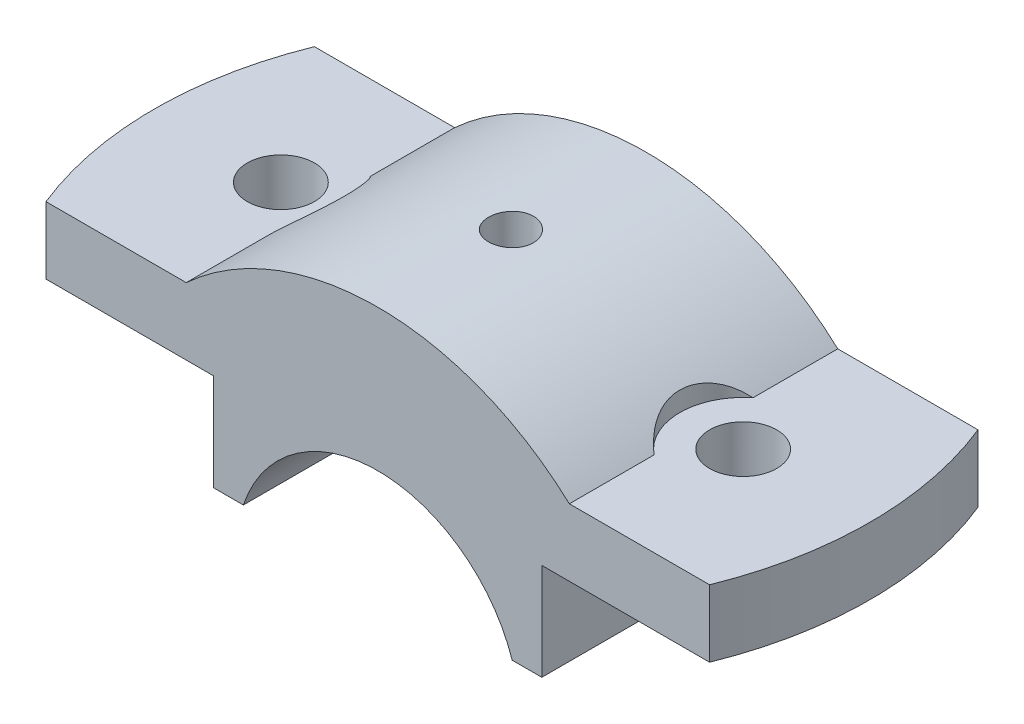
ISO-10303-21;
HEADER;
FILE_DESCRIPTION(('STEP AP214'),'2;1');
FILE_NAME('part.step','',(''),(''),'','','');
FILE_SCHEMA(('AUTOMOTIVE_DESIGN { 1 0 10303 214 1 1 1 1 }'));
ENDSEC;
DATA;
#1=APPLICATION_CONTEXT('core data for automotive mechanical design processes');
#2=APPLICATION_PROTOCOL_DEFINITION('international standard','automotive_design',2000,#1);
#3=PRODUCT_CONTEXT('',#1,'mechanical');
#4=PRODUCT('Part','Part','',(#3));
#5=PRODUCT_RELATED_PRODUCT_CATEGORY('part','',(#4));
#6=PRODUCT_DEFINITION_FORMATION('','',#4);
#7=PRODUCT_DEFINITION_CONTEXT('part definition',#1,'design');
#8=PRODUCT_DEFINITION('design','',#6,#7);
#9=PRODUCT_DEFINITION_SHAPE('','',#8);
#10=(LENGTH_UNIT() NAMED_UNIT(*) SI_UNIT(.MILLI.,.METRE.));
#11=(NAMED_UNIT(*) PLANE_ANGLE_UNIT() SI_UNIT($,.RADIAN.));
#12=(NAMED_UNIT(*) SI_UNIT($,.STERADIAN.) SOLID_ANGLE_UNIT());
#13=UNCERTAINTY_MEASURE_WITH_UNIT(LENGTH_MEASURE(1.E-05),#10,'distance_accuracy_value','');
#14=(GEOMETRIC_REPRESENTATION_CONTEXT(3) GLOBAL_UNCERTAINTY_ASSIGNED_CONTEXT((#13)) GLOBAL_UNIT_ASSIGNED_CONTEXT((#10,
#11,#12)) REPRESENTATION_CONTEXT('',''));
#15=CARTESIAN_POINT('',(0.,0.,0.));
#16=DIRECTION('',(0.,0.,1.));
#17=DIRECTION('',(1.,0.,0.));
#18=AXIS2_PLACEMENT_3D('',#15,#16,#17);
#19=CARTESIAN_POINT('',(0.,0.,-18.));
#20=DIRECTION('',(0.,0.,-1.));
#21=DIRECTION('',(-1.,0.,0.));
#22=AXIS2_PLACEMENT_3D('',#19,#20,#21);
#23=PLANE('',#22);
#24=DIRECTION('',(1.,0.,0.));
#25=VECTOR('',#24,1.);
#26=CARTESIAN_POINT('',(50.,28.,-18.));
#27=LINE('',#26,#25);
#28=CARTESIAN_POINT('',(25.6904651573303,28.,-18.));
#29=VERTEX_POINT('',#28);
#30=CARTESIAN_POINT('',(44.497190922574,28.,-18.));
#31=VERTEX_POINT('',#30);
#32=EDGE_CURVE('E181',#29,#31,#27,.T.);
#33=ORIENTED_EDGE('',*,*,#32,.T.);
#34=DIRECTION('',(0.,1.,0.));
#35=VECTOR('',#34,1.);
#36=CARTESIAN_POINT('',(44.497190922574,6.,-18.));
#37=LINE('',#36,#35);
#38=CARTESIAN_POINT('',(44.497190922574,19.,-18.));
#39=VERTEX_POINT('',#38);
#40=EDGE_CURVE('E140',#39,#31,#37,.T.);
#41=ORIENTED_EDGE('',*,*,#40,.F.);
#42=DIRECTION('',(-1.,0.,0.));
#43=VECTOR('',#42,1.);
#44=CARTESIAN_POINT('',(22.,19.,-18.));
#45=LINE('',#44,#43);
#46=CARTESIAN_POINT('',(22.,19.,-18.));
#47=VERTEX_POINT('',#46);
#48=EDGE_CURVE('E303',#39,#47,#45,.T.);
#49=ORIENTED_EDGE('',*,*,#48,.T.);
#50=DIRECTION('',(0.,-1.,0.));
#51=VECTOR('',#50,1.);
#52=CARTESIAN_POINT('',(22.,6.,-18.));
#53=LINE('',#52,#51);
#54=CARTESIAN_POINT('',(22.,6.,-18.));
#55=VERTEX_POINT('',#54);
#56=EDGE_CURVE('E162',#47,#55,#53,.T.);
#57=ORIENTED_EDGE('',*,*,#56,.T.);
#58=DIRECTION('',(-1.,0.,0.));
#59=VECTOR('',#58,1.);
#60=CARTESIAN_POINT('',(18.0277563773199,6.,-18.));
#61=LINE('',#60,#59);
#62=CARTESIAN_POINT('',(18.0277563773199,6.,-18.));
#63=VERTEX_POINT('',#62);
#64=EDGE_CURVE('E159',#55,#63,#61,.T.);
#65=ORIENTED_EDGE('',*,*,#64,.T.);
#66=CARTESIAN_POINT('',(0.,0.,-18.));
#67=DIRECTION('',(0.,0.,-1.));
#68=DIRECTION('',(-1.,0.,0.));
#69=AXIS2_PLACEMENT_3D('',#66,#67,#68);
#70=CIRCLE('',#69,19.);
#71=CARTESIAN_POINT('',(-18.0277563773199,6.,-18.));
#72=VERTEX_POINT('',#71);
#73=EDGE_CURVE('E182',#72,#63,#70,.T.);
#74=ORIENTED_EDGE('',*,*,#73,.F.);
#75=DIRECTION('',(1.,0.,0.));
#76=VECTOR('',#75,1.);
#77=CARTESIAN_POINT('',(-18.0277563773199,6.,-18.));
#78=LINE('',#77,#76);
#79=CARTESIAN_POINT('',(-22.,6.,-18.));
#80=VERTEX_POINT('',#79);
#81=EDGE_CURVE('E196',#80,#72,#78,.T.);
#82=ORIENTED_EDGE('',*,*,#81,.F.);
#83=DIRECTION('',(0.,-1.,0.));
#84=VECTOR('',#83,1.);
#85=CARTESIAN_POINT('',(-22.,6.,-18.));
#86=LINE('',#85,#84);
#87=CARTESIAN_POINT('',(-22.,19.,-18.));
#88=VERTEX_POINT('',#87);
#89=EDGE_CURVE('E193',#88,#80,#86,.T.);
#90=ORIENTED_EDGE('',*,*,#89,.F.);
#91=DIRECTION('',(1.,0.,0.));
#92=VECTOR('',#91,1.);
#93=CARTESIAN_POINT('',(-22.,19.,-18.));
#94=LINE('',#93,#92);
#95=CARTESIAN_POINT('',(-44.497190922574,19.,-18.));
#96=VERTEX_POINT('',#95);
#97=EDGE_CURVE('E191',#96,#88,#94,.T.);
#98=ORIENTED_EDGE('',*,*,#97,.F.);
#99=DIRECTION('',(0.,1.,0.));
#100=VECTOR('',#99,1.);
#101=CARTESIAN_POINT('',(-44.497190922574,6.,-18.));
#102=LINE('',#101,#100);
#103=CARTESIAN_POINT('',(-44.497190922574,28.,-18.));
#104=VERTEX_POINT('',#103);
#105=EDGE_CURVE('E362',#96,#104,#102,.T.);
#106=ORIENTED_EDGE('',*,*,#105,.T.);
#107=DIRECTION('',(-1.,0.,0.));
#108=VECTOR('',#107,1.);
#109=CARTESIAN_POINT('',(-50.,28.,-18.));
#110=LINE('',#109,#108);
#111=CARTESIAN_POINT('',(-25.6904651573303,28.,-18.));
#112=VERTEX_POINT('',#111);
#113=EDGE_CURVE('E188',#112,#104,#110,.T.);
#114=ORIENTED_EDGE('',*,*,#113,.F.);
#115=CARTESIAN_POINT('',(0.,0.,-18.));
#116=DIRECTION('',(0.,0.,1.));
#117=DIRECTION('',(-1.,0.,0.));
#118=AXIS2_PLACEMENT_3D('',#115,#116,#117);
#119=CIRCLE('',#118,38.);
#120=EDGE_CURVE('E184',#29,#112,#119,.T.);
#121=ORIENTED_EDGE('',*,*,#120,.F.);
#122=EDGE_LOOP('',(#33,#41,#49,#57,#65,#74,#82,#90,#98,#106,#114,#121));
#123=FACE_BOUND('',#122,.T.);
#124=ADVANCED_FACE('F33',(#123),#23,.T.);
#125=CARTESIAN_POINT('',(0.,0.,18.));
#126=DIRECTION('',(0.,0.,-1.));
#127=DIRECTION('',(-1.,0.,0.));
#128=AXIS2_PLACEMENT_3D('',#125,#126,#127);
#129=PLANE('',#128);
#130=DIRECTION('',(0.,1.,0.));
#131=VECTOR('',#130,1.);
#132=CARTESIAN_POINT('',(44.497190922574,6.,18.));
#133=LINE('',#132,#131);
#134=CARTESIAN_POINT('',(44.497190922574,19.,18.));
#135=VERTEX_POINT('',#134);
#136=CARTESIAN_POINT('',(44.497190922574,28.,18.));
#137=VERTEX_POINT('',#136);
#138=EDGE_CURVE('E53',#135,#137,#133,.T.);
#139=ORIENTED_EDGE('',*,*,#138,.T.);
#140=DIRECTION('',(1.,0.,0.));
#141=VECTOR('',#140,1.);
#142=CARTESIAN_POINT('',(50.,28.,18.));
#143=LINE('',#142,#141);
#144=CARTESIAN_POINT('',(25.6904651573303,28.,18.));
#145=VERTEX_POINT('',#144);
#146=EDGE_CURVE('E151',#145,#137,#143,.T.);
#147=ORIENTED_EDGE('',*,*,#146,.F.);
#148=CARTESIAN_POINT('',(0.,0.,18.));
#149=DIRECTION('',(0.,0.,1.));
#150=DIRECTION('',(-1.,0.,0.));
#151=AXIS2_PLACEMENT_3D('',#148,#149,#150);
#152=CIRCLE('',#151,38.);
#153=CARTESIAN_POINT('',(-25.6904651573303,28.,18.));
#154=VERTEX_POINT('',#153);
#155=EDGE_CURVE('E201',#145,#154,#152,.T.);
#156=ORIENTED_EDGE('',*,*,#155,.T.);
#157=DIRECTION('',(-1.,0.,0.));
#158=VECTOR('',#157,1.);
#159=CARTESIAN_POINT('',(-50.,28.,18.));
#160=LINE('',#159,#158);
#161=CARTESIAN_POINT('',(-44.497190922574,28.,18.));
#162=VERTEX_POINT('',#161);
#163=EDGE_CURVE('E203',#154,#162,#160,.T.);
#164=ORIENTED_EDGE('',*,*,#163,.T.);
#165=DIRECTION('',(0.,1.,0.));
#166=VECTOR('',#165,1.);
#167=CARTESIAN_POINT('',(-44.497190922574,6.,18.));
#168=LINE('',#167,#166);
#169=CARTESIAN_POINT('',(-44.497190922574,19.,18.));
#170=VERTEX_POINT('',#169);
#171=EDGE_CURVE('E230',#162,#170,#168,.F.);
#172=ORIENTED_EDGE('',*,*,#171,.T.);
#173=DIRECTION('',(1.,0.,0.));
#174=VECTOR('',#173,1.);
#175=CARTESIAN_POINT('',(-22.,19.,18.));
#176=LINE('',#175,#174);
#177=CARTESIAN_POINT('',(-22.,19.,18.));
#178=VERTEX_POINT('',#177);
#179=EDGE_CURVE('E206',#170,#178,#176,.T.);
#180=ORIENTED_EDGE('',*,*,#179,.T.);
#181=DIRECTION('',(0.,-1.,0.));
#182=VECTOR('',#181,1.);
#183=CARTESIAN_POINT('',(-22.,6.,18.));
#184=LINE('',#183,#182);
#185=CARTESIAN_POINT('',(-22.,6.,18.));
#186=VERTEX_POINT('',#185);
#187=EDGE_CURVE('E208',#178,#186,#184,.T.);
#188=ORIENTED_EDGE('',*,*,#187,.T.);
#189=DIRECTION('',(1.,0.,0.));
#190=VECTOR('',#189,1.);
#191=CARTESIAN_POINT('',(-18.0277563773199,6.,18.));
#192=LINE('',#191,#190);
#193=CARTESIAN_POINT('',(-18.0277563773199,6.,18.));
#194=VERTEX_POINT('',#193);
#195=EDGE_CURVE('E185',#186,#194,#192,.T.);
#196=ORIENTED_EDGE('',*,*,#195,.T.);
#197=CARTESIAN_POINT('',(0.,0.,18.));
#198=DIRECTION('',(0.,0.,-1.));
#199=DIRECTION('',(-1.,0.,0.));
#200=AXIS2_PLACEMENT_3D('',#197,#198,#199);
#201=CIRCLE('',#200,19.);
#202=CARTESIAN_POINT('',(18.0277563773199,6.,18.));
#203=VERTEX_POINT('',#202);
#204=EDGE_CURVE('E171',#194,#203,#201,.T.);
#205=ORIENTED_EDGE('',*,*,#204,.T.);
#206=DIRECTION('',(-1.,0.,0.));
#207=VECTOR('',#206,1.);
#208=CARTESIAN_POINT('',(18.0277563773199,6.,18.));
#209=LINE('',#208,#207);
#210=CARTESIAN_POINT('',(22.,6.,18.));
#211=VERTEX_POINT('',#210);
#212=EDGE_CURVE('E296',#211,#203,#209,.T.);
#213=ORIENTED_EDGE('',*,*,#212,.F.);
#214=DIRECTION('',(0.,-1.,0.));
#215=VECTOR('',#214,1.);
#216=CARTESIAN_POINT('',(22.,6.,18.));
#217=LINE('',#216,#215);
#218=CARTESIAN_POINT('',(22.,19.,18.));
#219=VERTEX_POINT('',#218);
#220=EDGE_CURVE('E164',#219,#211,#217,.T.);
#221=ORIENTED_EDGE('',*,*,#220,.F.);
#222=DIRECTION('',(-1.,0.,0.));
#223=VECTOR('',#222,1.);
#224=CARTESIAN_POINT('',(22.,19.,18.));
#225=LINE('',#224,#223);
#226=EDGE_CURVE('E153',#135,#219,#225,.T.);
#227=ORIENTED_EDGE('',*,*,#226,.F.);
#228=EDGE_LOOP('',(#139,#147,#156,#164,#172,#180,#188,#196,#205,#213,#221,#227));
#229=FACE_BOUND('',#228,.T.);
#230=ADVANCED_FACE('F149',(#229),#129,.F.);
#231=CARTESIAN_POINT('',(50.,28.,-18.));
#232=DIRECTION('',(0.,-1.,0.));
#233=DIRECTION('',(0.,0.,-1.));
#234=AXIS2_PLACEMENT_3D('',#231,#232,#233);
#235=PLANE('',#234);
#236=CARTESIAN_POINT('',(31.,28.,0.));
#237=DIRECTION('',(0.,1.,0.));
#238=DIRECTION('',(0.,0.,1.));
#239=AXIS2_PLACEMENT_3D('',#236,#237,#238);
#240=CIRCLE('',#239,4.49999999999999);
#241=CARTESIAN_POINT('',(31.,28.,4.49999999999999));
#242=VERTEX_POINT('',#241);
#243=EDGE_CURVE('E385',#242,#242,#240,.T.);
#244=ORIENTED_EDGE('',*,*,#243,.F.);
#245=EDGE_LOOP('',(#244));
#246=FACE_BOUND('',#245,.T.);
#247=CARTESIAN_POINT('',(0.,28.,0.));
#248=DIRECTION('',(0.,1.,0.));
#249=DIRECTION('',(0.,0.,-1.));
#250=AXIS2_PLACEMENT_3D('',#247,#248,#249);
#251=CIRCLE('',#250,48.);
#252=EDGE_CURVE('E137',#137,#31,#251,.T.);
#253=ORIENTED_EDGE('',*,*,#252,.T.);
#254=ORIENTED_EDGE('',*,*,#32,.F.);
#255=DIRECTION('',(0.,0.,1.));
#256=VECTOR('',#255,1.);
#257=CARTESIAN_POINT('',(25.6904651573303,28.,-18.));
#258=LINE('',#257,#256);
#259=CARTESIAN_POINT('',(25.6904651573303,28.,-6.63768331230679));
#260=VERTEX_POINT('',#259);
#261=EDGE_CURVE('E168',#29,#260,#258,.T.);
#262=ORIENTED_EDGE('',*,*,#261,.T.);
#263=CARTESIAN_POINT('',(31.,28.,0.));
#264=DIRECTION('',(0.,-1.,0.));
#265=DIRECTION('',(0.,0.,1.));
#266=AXIS2_PLACEMENT_3D('',#263,#264,#265);
#267=CIRCLE('',#266,8.5);
#268=CARTESIAN_POINT('',(25.6904651573303,28.,6.63768331230679));
#269=VERTEX_POINT('',#268);
#270=EDGE_CURVE('E353',#269,#260,#267,.T.);
#271=ORIENTED_EDGE('',*,*,#270,.F.);
#272=EDGE_CURVE('E157',#269,#145,#258,.T.);
#273=ORIENTED_EDGE('',*,*,#272,.T.);
#274=ORIENTED_EDGE('',*,*,#146,.T.);
#275=EDGE_LOOP('',(#253,#254,#262,#271,#273,#274));
#276=FACE_BOUND('',#275,.T.);
#277=ADVANCED_FACE('F155',(#246,#276),#235,.F.);
#278=CARTESIAN_POINT('',(22.,19.,-18.));
#279=DIRECTION('',(0.,1.,0.));
#280=DIRECTION('',(-1.,0.,0.));
#281=AXIS2_PLACEMENT_3D('',#278,#279,#280);
#282=PLANE('',#281);
#283=CARTESIAN_POINT('',(31.,19.,0.));
#284=DIRECTION('',(0.,1.,0.));
#285=DIRECTION('',(-1.,0.,0.));
#286=AXIS2_PLACEMENT_3D('',#283,#284,#285);
#287=CIRCLE('',#286,4.49999999999999);
#288=CARTESIAN_POINT('',(26.5,19.,0.));
#289=VERTEX_POINT('',#288);
#290=EDGE_CURVE('E382',#289,#289,#287,.T.);
#291=ORIENTED_EDGE('',*,*,#290,.T.);
#292=EDGE_LOOP('',(#291));
#293=FACE_BOUND('',#292,.T.);
#294=CARTESIAN_POINT('',(0.,19.,0.));
#295=DIRECTION('',(0.,1.,0.));
#296=DIRECTION('',(-1.,0.,0.));
#297=AXIS2_PLACEMENT_3D('',#294,#295,#296);
#298=CIRCLE('',#297,48.);
#299=EDGE_CURVE('E46',#135,#39,#298,.T.);
#300=ORIENTED_EDGE('',*,*,#299,.F.);
#301=ORIENTED_EDGE('',*,*,#226,.T.);
#302=DIRECTION('',(0.,0.,1.));
#303=VECTOR('',#302,1.);
#304=CARTESIAN_POINT('',(22.,19.,-18.));
#305=LINE('',#304,#303);
#306=EDGE_CURVE('E172',#47,#219,#305,.T.);
#307=ORIENTED_EDGE('',*,*,#306,.F.);
#308=ORIENTED_EDGE('',*,*,#48,.F.);
#309=EDGE_LOOP('',(#300,#301,#307,#308));
#310=FACE_BOUND('',#309,.T.);
#311=ADVANCED_FACE('F251',(#293,#310),#282,.F.);
#312=CARTESIAN_POINT('',(0.,0.,-18.));
#313=DIRECTION('',(0.,0.,1.));
#314=DIRECTION('',(1.,0.,0.));
#315=AXIS2_PLACEMENT_3D('',#312,#313,#314);
#316=CYLINDRICAL_SURFACE('',#315,38.);
#317=CARTESIAN_POINT('',(-3.1458817359675,37.8695580658569,0.));
#318=CARTESIAN_POINT('',(-3.14587437994102,37.8695596692857,0.168229356223722));
#319=CARTESIAN_POINT('',(-3.1316880525212,37.8707454515949,0.336574006245494));
#320=CARTESIAN_POINT('',(-3.07530332802036,37.8753650637653,0.668607649957892));
#321=CARTESIAN_POINT('',(-3.03307298830084,37.8788014570518,0.83229111249956));
#322=CARTESIAN_POINT('',(-2.92182616659471,37.8875444761835,1.1501452237575));
#323=CARTESIAN_POINT('',(-2.85282462512546,37.892850058717,1.30432112294824));
#324=CARTESIAN_POINT('',(-2.6900185025226,37.90475471927,1.59886160168987));
#325=CARTESIAN_POINT('',(-2.59621931204265,37.9113535160827,1.73922917388467));
#326=CARTESIAN_POINT('',(-2.38624301776559,37.9251487044451,2.00253137226757));
#327=CARTESIAN_POINT('',(-2.27002035602962,37.9323462953406,2.12542960763649));
#328=CARTESIAN_POINT('',(-2.01859004696914,37.9465560480246,2.34999209013841));
#329=CARTESIAN_POINT('',(-1.88338157954225,37.9535682017876,2.45165541954577));
#330=CARTESIAN_POINT('',(-1.59760066015428,37.9666712775513,2.63098168610704));
#331=CARTESIAN_POINT('',(-1.44700854301351,37.9727609950746,2.708613379424));
#332=CARTESIAN_POINT('',(-1.13487054889193,37.9833704253793,2.83747282349098));
#333=CARTESIAN_POINT('',(-0.973324846202923,37.987890163135,2.88870099425837));
#334=CARTESIAN_POINT('',(-0.644224315781861,37.9948943007702,2.96319512715381));
#335=CARTESIAN_POINT('',(-0.476682834761507,37.9973829594895,2.98651964678537));
#336=CARTESIAN_POINT('',(-0.140044955685562,38.0001146758458,3.0047253592679));
#337=CARTESIAN_POINT('',(0.0290514160698927,38.0003577713957,2.99960703233397));
#338=CARTESIAN_POINT('',(0.363601957188222,37.9986279022662,2.96112032248106));
#339=CARTESIAN_POINT('',(0.529063402630801,37.9966598742563,2.92781491240173));
#340=CARTESIAN_POINT('',(0.852047650227197,37.9907899596693,2.83399732705022));
#341=CARTESIAN_POINT('',(1.00957038342975,37.9868880562987,2.77348491551835));
#342=CARTESIAN_POINT('',(1.31240509330863,37.9776328068828,2.62690060373557));
#343=CARTESIAN_POINT('',(1.45770332945107,37.972277855404,2.54080042217035));
#344=CARTESIAN_POINT('',(1.73181259590439,37.960764940049,2.34550517866702));
#345=CARTESIAN_POINT('',(1.86062332654852,37.9546069615815,2.23630969705861));
#346=CARTESIAN_POINT('',(2.09846708827653,37.9422019527286,1.99756841972296));
#347=CARTESIAN_POINT('',(2.20744520522019,37.9359547252317,1.86796791907116));
#348=CARTESIAN_POINT('',(2.40210396423434,37.9241273765005,1.59228636571935));
#349=CARTESIAN_POINT('',(2.48778458983251,37.9185472557377,1.44620530136698));
#350=CARTESIAN_POINT('',(2.63341176605231,37.9087126702961,1.14167162060739));
#351=CARTESIAN_POINT('',(2.69335559209279,37.9044583459834,0.983217696466577));
#352=CARTESIAN_POINT('',(2.78576609633738,37.8977792566554,0.658454052626345));
#353=CARTESIAN_POINT('',(2.81823329228586,37.8953544571664,0.492144481013881));
#354=CARTESIAN_POINT('',(2.85469879763537,37.8926250743431,0.156870629588009));
#355=CARTESIAN_POINT('',(2.85877365119076,37.8923147904437,-0.0120852808075258));
#356=CARTESIAN_POINT('',(2.83853908183502,37.8938358419192,-0.348277674479458));
#357=CARTESIAN_POINT('',(2.81422989615653,37.8956671593946,-0.515514172114852));
#358=CARTESIAN_POINT('',(2.73798168232659,37.9012519510283,-0.843301603254928));
#359=CARTESIAN_POINT('',(2.68607826501754,37.9050029475742,-1.00386086655318));
#360=CARTESIAN_POINT('',(2.55615238559372,37.9139855568988,-1.31399395677734));
#361=CARTESIAN_POINT('',(2.47812954670919,37.9192171910354,-1.46356762519929));
#362=CARTESIAN_POINT('',(2.2979872666667,37.9305600537958,-1.74783416137562));
#363=CARTESIAN_POINT('',(2.19581675961448,37.9366731356157,-1.88249459296493));
#364=CARTESIAN_POINT('',(1.97035540087016,37.9490502222694,-2.13278456634996));
#365=CARTESIAN_POINT('',(1.84706422262255,37.9553142294356,-2.24841381384239));
#366=CARTESIAN_POINT('',(1.5825330622276,37.9672638511389,-2.45761968980163));
#367=CARTESIAN_POINT('',(1.44125372985819,37.9729481468879,-2.55114664697588));
#368=CARTESIAN_POINT('',(1.14495525345122,37.983035969604,-2.71315246287969));
#369=CARTESIAN_POINT('',(0.989936234584203,37.9874395082375,-2.78163154976985));
#370=CARTESIAN_POINT('',(0.670739514283648,37.9944146158817,-2.8915121915042));
#371=CARTESIAN_POINT('',(0.506572492167628,37.996988274693,-2.93294463032733));
#372=CARTESIAN_POINT('',(0.173593831336894,37.9999680707691,-2.98765683143964));
#373=CARTESIAN_POINT('',(0.00478227068112589,38.0003742444396,-3.00093706657949));
#374=CARTESIAN_POINT('',(-0.332203125642705,37.9989204613857,-2.99896261174756));
#375=CARTESIAN_POINT('',(-0.5003774473114,37.9970666629141,-2.98378540562109));
#376=CARTESIAN_POINT('',(-0.83177276800804,37.9912572809989,-2.92548825985853));
#377=CARTESIAN_POINT('',(-0.994993759767166,37.9873016944712,-2.88236827921959));
#378=CARTESIAN_POINT('',(-1.31185669977632,37.9776799810049,-2.76942883565186));
#379=CARTESIAN_POINT('',(-1.46549906674205,37.9720139289001,-2.69961054075428));
#380=CARTESIAN_POINT('',(-1.75888889286831,37.9595560686898,-2.53526551305572));
#381=CARTESIAN_POINT('',(-1.89863660438796,37.9527642810362,-2.44073922912224));
#382=CARTESIAN_POINT('',(-2.16066823837924,37.9387506891864,-2.22937105364119));
#383=CARTESIAN_POINT('',(-2.28290599631364,37.9315278168967,-2.11247200370349));
#384=CARTESIAN_POINT('',(-2.50607333703597,37.9174384052283,-1.85977604977668));
#385=CARTESIAN_POINT('',(-2.60699774008364,37.9105719527746,-1.72397456524185));
#386=CARTESIAN_POINT('',(-2.78479740951612,37.8979272091236,-1.43709086811672));
#387=CARTESIAN_POINT('',(-2.86163094976766,37.8921508127505,-1.28598273615028));
#388=CARTESIAN_POINT('',(-2.98874444503889,37.8823376902094,-0.97306834736823));
#389=CARTESIAN_POINT('',(-3.03905506281121,37.8782989561542,-0.811274688620422));
#390=CARTESIAN_POINT('',(-3.09882056806893,37.873444865864,-0.54043166318695));
#391=CARTESIAN_POINT('',(-3.11644521469423,37.8719937513483,-0.433126408915516));
#392=CARTESIAN_POINT('',(-3.13997815996934,37.8700498347475,-0.217230128113446));
#393=CARTESIAN_POINT('',(-3.14588648634014,37.8695570303951,-0.10863910462557));
#394=CARTESIAN_POINT('',(-3.1458817359675,37.8695580658569,0.));
#395=B_SPLINE_CURVE_WITH_KNOTS('',3,(#317,#318,#319,#320,#321,#322,#323,#324,#325,#326,#327,
#328,#329,#330,#331,#332,#333,#334,#335,#336,#337,#338,#339,#340,#341,#342,#343,#344,#345,#346,
#347,#348,#349,#350,#351,#352,#353,#354,#355,#356,#357,#358,#359,#360,#361,#362,#363,#364,#365,
#366,#367,#368,#369,#370,#371,#372,#373,#374,#375,#376,#377,#378,#379,#380,#381,#382,#383,#384,
#385,#386,#387,#388,#389,#390,#391,#392,#393,#394),.UNSPECIFIED.,.T.,.F.,(4,2,2,2,2,2,2,2,2,2,2,
2,2,2,2,2,2,2,2,2,2,2,2,2,2,2,2,2,2,2,2,2,2,2,2,2,2,2,4),(0.,0.504291421669989,1.00915822788302,
1.51374368152856,2.01821953559138,2.52373134073237,3.02926498845646,3.53545315301367,
4.04163326507021,4.546749253583,5.05185671399058,5.55583868228782,6.05982502713927,
6.56437049631086,7.06892513448829,7.5748562462125,8.08078771565083,8.58677273143866,
9.09274821269729,9.59735908295554,10.1019657357268,10.6059227598395,11.10988705379,
11.6149267875576,12.1199743306602,12.6261463157288,13.1323136899712,13.6379020669613,
14.1434819519092,14.6476872439429,15.1518932758423,15.6560772516295,16.1602520685946,
16.6657325841807,17.1713358046312,17.6778099691558,18.1836973153047,18.5093592531183,
18.8350204204102),.UNSPECIFIED.);
#396=CARTESIAN_POINT('',(-3.1458817359675,37.8695580658569,0.));
#397=VERTEX_POINT('',#396);
#398=EDGE_CURVE('E11',#397,#397,#395,.T.);
#399=ORIENTED_EDGE('',*,*,#398,.F.);
#400=EDGE_LOOP('',(#399));
#401=FACE_BOUND('',#400,.T.);
#402=CARTESIAN_POINT('',(25.6904651573303,28.,-6.63768331230679));
#403=CARTESIAN_POINT('',(25.5360851043424,28.1416681018721,-6.51420867249736));
#404=CARTESIAN_POINT('',(25.3836215551735,28.2791823336498,-6.38340380017067));
#405=CARTESIAN_POINT('',(25.0841053598261,28.5451833866574,-6.1068595072457));
#406=CARTESIAN_POINT('',(24.9370580895264,28.6736613482156,-5.96110576476093));
#407=CARTESIAN_POINT('',(24.6491941230388,28.9215085426633,-5.65349144226199));
#408=CARTESIAN_POINT('',(24.508431723833,29.0408031542341,-5.49151942353938));
#409=CARTESIAN_POINT('',(24.2363075607749,29.2682904084011,-5.15263687836668));
#410=CARTESIAN_POINT('',(24.1049430857226,29.3764862568107,-4.97573069263071));
#411=CARTESIAN_POINT('',(23.8528205053459,29.5815743674557,-4.60631493821571));
#412=CARTESIAN_POINT('',(23.7321338833277,29.6783916917415,-4.41371469093333));
#413=CARTESIAN_POINT('',(23.5043908446779,29.85908164754,-4.01479632179463));
#414=CARTESIAN_POINT('',(23.3973358972541,29.942952883943,-3.80847672492268));
#415=CARTESIAN_POINT('',(23.1992536300817,30.0966827286364,-3.38422419101503));
#416=CARTESIAN_POINT('',(23.1081729651954,30.1665880882949,-3.16633319991269));
#417=CARTESIAN_POINT('',(22.9434688496595,30.2920447623401,-2.72008092153073));
#418=CARTESIAN_POINT('',(22.869842066784,30.347598816803,-2.49172164276592));
#419=CARTESIAN_POINT('',(22.7499342032063,30.4375648556656,-2.05682098381954));
#420=CARTESIAN_POINT('',(22.7013462567531,30.4737833576563,-1.8512853482319));
#421=CARTESIAN_POINT('',(22.6194172898017,30.534645499234,-1.43551725204114));
#422=CARTESIAN_POINT('',(22.5860747992536,30.5592902548309,-1.22528524633889));
#423=CARTESIAN_POINT('',(22.5352129551669,30.5968164834569,-0.801799591498516));
#424=CARTESIAN_POINT('',(22.5176992505084,30.6096937569973,-0.58854489119391));
#425=CARTESIAN_POINT('',(22.4988301660851,30.6235658271181,-0.160939560666223));
#426=CARTESIAN_POINT('',(22.4974739036633,30.624561272785,0.0534110090511445));
#427=CARTESIAN_POINT('',(22.5103301119086,30.6151119876343,0.461997479818161));
#428=CARTESIAN_POINT('',(22.5231488228924,30.6056914251709,0.656303160135787));
#429=CARTESIAN_POINT('',(22.5619809221014,30.5770763766543,1.04286259298842));
#430=CARTESIAN_POINT('',(22.5879939672906,30.5578821447042,1.2351163987369));
#431=CARTESIAN_POINT('',(22.6528192304938,30.5098574663833,1.61613906729811));
#432=CARTESIAN_POINT('',(22.6916259266854,30.4810311771979,1.8049093965495));
#433=CARTESIAN_POINT('',(22.7814851533843,30.4139289484325,2.17779604427595));
#434=CARTESIAN_POINT('',(22.8325379785097,30.3756527815061,2.36191225066404));
#435=CARTESIAN_POINT('',(22.9463727274414,30.2897519777021,2.72495933677604));
#436=CARTESIAN_POINT('',(23.0091940590921,30.2420959034169,2.90387039063448));
#437=CARTESIAN_POINT('',(23.1456283742011,30.1378044455698,3.25489148863351));
#438=CARTESIAN_POINT('',(23.2192449894415,30.0811660396201,3.42699921914351));
#439=CARTESIAN_POINT('',(23.3763137314078,29.9592695660632,3.76349373210637));
#440=CARTESIAN_POINT('',(23.4597660818508,29.8940113023904,3.92788033882067));
#441=CARTESIAN_POINT('',(23.635527045378,29.7552415450916,4.24828704232644));
#442=CARTESIAN_POINT('',(23.7278387953854,29.6817271265587,4.40430414494657));
#443=CARTESIAN_POINT('',(23.9282386479047,29.5204551498757,4.71995510834893));
#444=CARTESIAN_POINT('',(24.0370002176616,29.432022004933,4.87881602386907));
#445=CARTESIAN_POINT('',(24.2623844714665,29.2465042091278,5.18563329619881));
#446=CARTESIAN_POINT('',(24.379010630913,29.1494157272481,5.33358477081363));
#447=CARTESIAN_POINT('',(24.6187042069683,28.9472618083659,5.61815393006347));
#448=CARTESIAN_POINT('',(24.7417672458198,28.8422017715012,5.75477915839728));
#449=CARTESIAN_POINT('',(24.9931857635632,28.6246099475779,6.01673825944901));
#450=CARTESIAN_POINT('',(25.121541230047,28.5120781780363,6.14207215863706));
#451=CARTESIAN_POINT('',(25.3239635142993,28.3320696328102,6.32788833390875));
#452=CARTESIAN_POINT('',(25.3966039536003,28.2669811541268,6.39227987552886));
#453=CARTESIAN_POINT('',(25.5428336292653,28.1349133065772,6.5175597465675));
#454=CARTESIAN_POINT('',(25.6164208573994,28.0679376662269,6.57845434819235));
#455=CARTESIAN_POINT('',(25.6904651573302,28.0000000000002,6.63768331230705));
#456=B_SPLINE_CURVE_WITH_KNOTS('',3,(#402,#403,#404,#405,#406,#407,#408,#409,#410,#411,#412,
#413,#414,#415,#416,#417,#418,#419,#420,#421,#422,#423,#424,#425,#426,#427,#428,#429,#430,#431,
#432,#433,#434,#435,#436,#437,#438,#439,#440,#441,#442,#443,#444,#445,#446,#447,#448,#449,#450,
#451,#452,#453,#454,#455),.UNSPECIFIED.,.F.,.F.,(4,2,2,2,2,2,2,2,2,2,2,2,2,2,2,2,2,2,2,2,2,2,2,
2,2,2,4),(0.,0.729592400834071,1.45989044138352,2.19560470883999,2.93110586753776,
3.67120763552799,4.41138910352644,5.14904966030398,5.88656927223681,6.52855006409986,
7.1704689396149,7.81261680885221,8.45472959834447,9.03890309081733,9.62306139629815,
10.2069679046447,10.7908884620571,11.3768004587137,11.9629100238154,12.549032922753,
13.1353641263273,13.7703169673958,14.4055522594533,15.040361004022,15.6751682603777,
16.0257258218313,16.3756336015193),.UNSPECIFIED.);
#457=EDGE_CURVE('E298',#260,#269,#456,.T.);
#458=ORIENTED_EDGE('',*,*,#457,.F.);
#459=ORIENTED_EDGE('',*,*,#261,.F.);
#460=ORIENTED_EDGE('',*,*,#120,.T.);
#461=DIRECTION('',(0.,0.,1.));
#462=VECTOR('',#461,1.);
#463=CARTESIAN_POINT('',(-25.6904651573303,28.,-18.));
#464=LINE('',#463,#462);
#465=CARTESIAN_POINT('',(-25.6904651573303,28.,-6.63768331230679));
#466=VERTEX_POINT('',#465);
#467=EDGE_CURVE('E221',#112,#466,#464,.T.);
#468=ORIENTED_EDGE('',*,*,#467,.T.);
#469=CARTESIAN_POINT('',(-25.6904651573303,28.,-6.63768331230679));
#470=CARTESIAN_POINT('',(-25.5360851043424,28.1416681018721,-6.51420867249736));
#471=CARTESIAN_POINT('',(-25.3836215551735,28.2791823336498,-6.38340380017067));
#472=CARTESIAN_POINT('',(-25.0841053598261,28.5451833866574,-6.1068595072457));
#473=CARTESIAN_POINT('',(-24.9370580895264,28.6736613482156,-5.96110576476093));
#474=CARTESIAN_POINT('',(-24.6491941230388,28.9215085426633,-5.65349144226199));
#475=CARTESIAN_POINT('',(-24.508431723833,29.0408031542341,-5.49151942353939));
#476=CARTESIAN_POINT('',(-24.2363075607749,29.2682904084011,-5.15263687836669));
#477=CARTESIAN_POINT('',(-24.1049430857226,29.3764862568107,-4.97573069263071));
#478=CARTESIAN_POINT('',(-23.8528205053459,29.5815743674557,-4.60631493821572));
#479=CARTESIAN_POINT('',(-23.7321338833277,29.6783916917415,-4.41371469093334));
#480=CARTESIAN_POINT('',(-23.5043908446779,29.85908164754,-4.01479632179464));
#481=CARTESIAN_POINT('',(-23.3973358972541,29.942952883943,-3.80847672492269));
#482=CARTESIAN_POINT('',(-23.1992536300817,30.0966827286364,-3.38422419101504));
#483=CARTESIAN_POINT('',(-23.1081729651954,30.1665880882949,-3.1663331999127));
#484=CARTESIAN_POINT('',(-22.9434688496595,30.2920447623401,-2.72008092153074));
#485=CARTESIAN_POINT('',(-22.869842066784,30.347598816803,-2.49172164276593));
#486=CARTESIAN_POINT('',(-22.7499342032063,30.4375648556656,-2.05682098381955));
#487=CARTESIAN_POINT('',(-22.7013462567531,30.4737833576563,-1.85128534823191));
#488=CARTESIAN_POINT('',(-22.6194172898017,30.534645499234,-1.43551725204115));
#489=CARTESIAN_POINT('',(-22.5860747992536,30.5592902548309,-1.2252852463389));
#490=CARTESIAN_POINT('',(-22.5352129551669,30.5968164834569,-0.801799591498527));
#491=CARTESIAN_POINT('',(-22.5176992505084,30.6096937569973,-0.588544891193921));
#492=CARTESIAN_POINT('',(-22.4988301660851,30.6235658271181,-0.160939560666234));
#493=CARTESIAN_POINT('',(-22.4974739036633,30.624561272785,0.0534110090511331));
#494=CARTESIAN_POINT('',(-22.5103301119086,30.6151119876343,0.461997479818149));
#495=CARTESIAN_POINT('',(-22.5231488228924,30.6056914251709,0.656303160135775));
#496=CARTESIAN_POINT('',(-22.5619809221014,30.5770763766543,1.04286259298841));
#497=CARTESIAN_POINT('',(-22.5879939672906,30.5578821447042,1.23511639873689));
#498=CARTESIAN_POINT('',(-22.6528192304938,30.5098574663833,1.6161390672981));
#499=CARTESIAN_POINT('',(-22.6916259266854,30.4810311771979,1.80490939654949));
#500=CARTESIAN_POINT('',(-22.7814851533843,30.4139289484325,2.17779604427594));
#501=CARTESIAN_POINT('',(-22.8325379785097,30.3756527815061,2.36191225066403));
#502=CARTESIAN_POINT('',(-22.9463727274414,30.2897519777021,2.72495933677603));
#503=CARTESIAN_POINT('',(-23.0091940590921,30.2420959034169,2.90387039063447));
#504=CARTESIAN_POINT('',(-23.1456283742011,30.1378044455698,3.2548914886335));
#505=CARTESIAN_POINT('',(-23.2192449894415,30.0811660396201,3.4269992191435));
#506=CARTESIAN_POINT('',(-23.3763137314078,29.9592695660632,3.76349373210637));
#507=CARTESIAN_POINT('',(-23.4597660818508,29.8940113023904,3.92788033882065));
#508=CARTESIAN_POINT('',(-23.635527045378,29.7552415450916,4.24828704232642));
#509=CARTESIAN_POINT('',(-23.7278387953854,29.6817271265587,4.40430414494655));
#510=CARTESIAN_POINT('',(-23.9282386479047,29.5204551498758,4.71995510834892));
#511=CARTESIAN_POINT('',(-24.0370002176616,29.432022004933,4.87881602386906));
#512=CARTESIAN_POINT('',(-24.2623844714665,29.2465042091278,5.1856332961988));
#513=CARTESIAN_POINT('',(-24.379010630913,29.1494157272481,5.33358477081362));
#514=CARTESIAN_POINT('',(-24.6187042069683,28.9472618083659,5.61815393006346));
#515=CARTESIAN_POINT('',(-24.7417672458198,28.8422017715012,5.75477915839727));
#516=CARTESIAN_POINT('',(-24.9931857635632,28.6246099475779,6.016738259449));
#517=CARTESIAN_POINT('',(-25.121541230047,28.5120781780363,6.14207215863705));
#518=CARTESIAN_POINT('',(-25.3239635142993,28.3320696328102,6.32788833390874));
#519=CARTESIAN_POINT('',(-25.3966039536003,28.2669811541268,6.39227987552885));
#520=CARTESIAN_POINT('',(-25.5428336292653,28.1349133065772,6.5175597465675));
#521=CARTESIAN_POINT('',(-25.6164208573994,28.0679376662269,6.57845434819235));
#522=CARTESIAN_POINT('',(-25.6904651573302,28.0000000000002,6.63768331230705));
#523=B_SPLINE_CURVE_WITH_KNOTS('',3,(#469,#470,#471,#472,#473,#474,#475,#476,#477,#478,#479,
#480,#481,#482,#483,#484,#485,#486,#487,#488,#489,#490,#491,#492,#493,#494,#495,#496,#497,#498,
#499,#500,#501,#502,#503,#504,#505,#506,#507,#508,#509,#510,#511,#512,#513,#514,#515,#516,#517,
#518,#519,#520,#521,#522),.UNSPECIFIED.,.F.,.F.,(4,2,2,2,2,2,2,2,2,2,2,2,2,2,2,2,2,2,2,2,2,2,2,
2,2,2,4),(0.,0.729592400834072,1.45989044138352,2.19560470883998,2.93110586753775,
3.67120763552798,4.41138910352642,5.14904966030397,5.88656927223679,6.52855006409984,
7.17046893961488,7.8126168088522,8.45472959834445,9.03890309081731,9.62306139629813,
10.2069679046447,10.7908884620571,11.3768004587137,11.9629100238154,12.549032922753,
13.1353641263273,13.7703169673958,14.4055522594533,15.040361004022,15.6751682603777,
16.0257258218313,16.3756336015193),.UNSPECIFIED.);
#524=CARTESIAN_POINT('',(-25.6904651573303,28.,6.63768331230679));
#525=VERTEX_POINT('',#524);
#526=EDGE_CURVE('E215',#466,#525,#523,.T.);
#527=ORIENTED_EDGE('',*,*,#526,.T.);
#528=EDGE_CURVE('E199',#525,#154,#464,.T.);
#529=ORIENTED_EDGE('',*,*,#528,.T.);
#530=ORIENTED_EDGE('',*,*,#155,.F.);
#531=ORIENTED_EDGE('',*,*,#272,.F.);
#532=EDGE_LOOP('',(#458,#459,#460,#468,#527,#529,#530,#531));
#533=FACE_BOUND('',#532,.T.);
#534=ADVANCED_FACE('F232',(#401,#533),#316,.T.);
#535=CARTESIAN_POINT('',(0.,0.,-18.));
#536=DIRECTION('',(0.,0.,1.));
#537=DIRECTION('',(1.,0.,0.));
#538=AXIS2_PLACEMENT_3D('',#535,#536,#537);
#539=CYLINDRICAL_SURFACE('',#538,19.);
#540=CARTESIAN_POINT('',(-2.5725256095053,18.8250394950034,0.));
#541=CARTESIAN_POINT('',(-2.57251971341776,18.8250416164449,-0.139772410707228));
#542=CARTESIAN_POINT('',(-2.56077038338678,18.8266574599554,-0.279630654917696));
#543=CARTESIAN_POINT('',(-2.51408774980407,18.8329470903244,-0.555450449604444));
#544=CARTESIAN_POINT('',(-2.47913061647571,18.8376240202372,-0.691407844841228));
#545=CARTESIAN_POINT('',(-2.3870831226454,18.8495085831264,-0.955392840298785));
#546=CARTESIAN_POINT('',(-2.33000826597046,18.8567144430696,-1.08342592246777));
#547=CARTESIAN_POINT('',(-2.19537727057092,18.872861300043,-1.32807015559524));
#548=CARTESIAN_POINT('',(-2.11782446470664,18.8818020146566,-1.44468316098251));
#549=CARTESIAN_POINT('',(-1.94392265658813,18.9004982105995,-1.66392100396941));
#550=CARTESIAN_POINT('',(-1.84747211106115,18.9102579230538,-1.7664649447672));
#551=CARTESIAN_POINT('',(-1.63872836177929,18.9294884592272,-1.95395445346304));
#552=CARTESIAN_POINT('',(-1.52643435053942,18.938959268192,-2.03889912384395));
#553=CARTESIAN_POINT('',(-1.28867736751459,18.956622875967,-2.1890712575453));
#554=CARTESIAN_POINT('',(-1.16316754454754,18.9648108532535,-2.25422515928236));
#555=CARTESIAN_POINT('',(-0.902860842201549,18.9789834576856,-2.36249489410533));
#556=CARTESIAN_POINT('',(-0.768064343473081,18.9849681750766,-2.40561162986091));
#557=CARTESIAN_POINT('',(-0.493837869178414,18.9940734603745,-2.46834044520401));
#558=CARTESIAN_POINT('',(-0.354439278201871,18.9972104281395,-2.48808731176756));
#559=CARTESIAN_POINT('',(-0.0742724952622652,19.0003711556383,-2.50393376893561));
#560=CARTESIAN_POINT('',(0.0664956370736352,19.000395050308,-2.50003438449259));
#561=CARTESIAN_POINT('',(0.344487726796048,18.9973824282937,-2.46880664147129));
#562=CARTESIAN_POINT('',(0.481728213317539,18.9943648281214,-2.44162325419791));
#563=CARTESIAN_POINT('',(0.749692748802871,18.9856773311083,-2.36482599286765));
#564=CARTESIAN_POINT('',(0.880416662648665,18.9800073792977,-2.31521165393022));
#565=CARTESIAN_POINT('',(1.13208174598104,18.966663757966,-2.19480811452033));
#566=CARTESIAN_POINT('',(1.25299277622202,18.9589842002188,-2.12395659803214));
#567=CARTESIAN_POINT('',(1.48126826982187,18.9425173075254,-1.96313528742037));
#568=CARTESIAN_POINT('',(1.58863204469934,18.9337299163237,-1.87316452226583));
#569=CARTESIAN_POINT('',(1.78761514215763,18.9159854832907,-1.67584774631526));
#570=CARTESIAN_POINT('',(1.87910909512051,18.9070276606979,-1.5683753315042));
#571=CARTESIAN_POINT('',(2.04277656990522,18.8900464700716,-1.33953904763814));
#572=CARTESIAN_POINT('',(2.11495001875081,18.8820231055677,-1.21817512611544));
#573=CARTESIAN_POINT('',(2.23793458433821,18.8678430617811,-0.964884545898979));
#574=CARTESIAN_POINT('',(2.2887349576982,18.8616873217104,-0.832952614660604));
#575=CARTESIAN_POINT('',(2.36741435749702,18.8519743089119,-0.562332271850076));
#576=CARTESIAN_POINT('',(2.39529461254355,18.8484168969047,-0.423644222854374));
#577=CARTESIAN_POINT('',(2.42717357704179,18.844338381925,-0.144557770604838));
#578=CARTESIAN_POINT('',(2.43134912626647,18.8437947961836,-0.00417988267501946));
#579=CARTESIAN_POINT('',(2.41616721487865,18.8457473257976,0.275273112895704));
#580=CARTESIAN_POINT('',(2.39681031155826,18.8482433691688,0.414348251309536));
#581=CARTESIAN_POINT('',(2.33526297492743,18.8559670391786,0.686713845320679));
#582=CARTESIAN_POINT('',(2.29315877504058,18.861184347126,0.820024106929614));
#583=CARTESIAN_POINT('',(2.18740276161155,18.8737407003649,1.07769659074713));
#584=CARTESIAN_POINT('',(2.12375011410471,18.8810798277731,1.20205846641077));
#585=CARTESIAN_POINT('',(1.97627419019128,18.8970858324266,1.43910187947633));
#586=CARTESIAN_POINT('',(1.89233534074461,18.9057602100679,1.55171099776969));
#587=CARTESIAN_POINT('',(1.70683540633676,18.9234080327509,1.76131206225707));
#588=CARTESIAN_POINT('',(1.60527356018986,18.9323814906972,1.8583033335243));
#589=CARTESIAN_POINT('',(1.38663968722456,18.9496519196906,2.03453978862285));
#590=CARTESIAN_POINT('',(1.26947342189993,18.9579442418785,2.11366858191608));
#591=CARTESIAN_POINT('',(1.02341599516977,18.9728171283922,2.25112719879753));
#592=CARTESIAN_POINT('',(0.894525091741951,18.9793977303688,2.30945747987743));
#593=CARTESIAN_POINT('',(0.629060476293748,18.9900463959186,2.40347261332034));
#594=CARTESIAN_POINT('',(0.4925105773906,18.994121822169,2.43922383380948));
#595=CARTESIAN_POINT('',(0.215292557669472,18.9992856944545,2.48728165155039));
#596=CARTESIAN_POINT('',(0.0746246440225006,19.0003742904924,2.49958942615497));
#597=CARTESIAN_POINT('',(-0.205701281017037,18.9993996561718,2.50038732371433));
#598=CARTESIAN_POINT('',(-0.345358898759009,18.9973601600212,2.48905656815023));
#599=CARTESIAN_POINT('',(-0.620754750329817,18.9903565970814,2.44327953837194));
#600=CARTESIAN_POINT('',(-0.756492989026453,18.9853925339245,2.40883329286806));
#601=CARTESIAN_POINT('',(-1.02016852521723,18.9730515049674,2.31786118504363));
#602=CARTESIAN_POINT('',(-1.14810916439983,18.9656755815281,2.26134485895363));
#603=CARTESIAN_POINT('',(-1.39271230009311,18.9492848733412,2.12785549941422));
#604=CARTESIAN_POINT('',(-1.50937460420562,18.9402700606433,2.05088211706991));
#605=CARTESIAN_POINT('',(-1.72902556912442,18.9214885520922,1.87800438938243));
#606=CARTESIAN_POINT('',(-1.83190906820699,18.9117168831426,1.78196696135376));
#607=CARTESIAN_POINT('',(-2.02016923524658,18.8925354273719,1.57396529634803));
#608=CARTESIAN_POINT('',(-2.10554176272956,18.8831257265647,1.46199730315986));
#609=CARTESIAN_POINT('',(-2.25667655005125,18.8656630176701,1.22475904167365));
#610=CARTESIAN_POINT('',(-2.32235334397736,18.857615986484,1.09943390887033));
#611=CARTESIAN_POINT('',(-2.43164154454286,18.8438366716912,0.839492467959365));
#612=CARTESIAN_POINT('',(-2.47527668104404,18.838101900074,0.704886329967059));
#613=CARTESIAN_POINT('',(-2.52893066337215,18.8309575631524,0.474670862248904));
#614=CARTESIAN_POINT('',(-2.54525492605289,18.8287492860504,0.380506812944519));
#615=CARTESIAN_POINT('',(-2.56705436524711,18.8257895338204,0.190908517840831));
#616=CARTESIAN_POINT('',(-2.5725296369434,18.8250380459113,0.095474283192799));
#617=CARTESIAN_POINT('',(-2.5725256095053,18.8250394950034,0.));
#618=B_SPLINE_CURVE_WITH_KNOTS('',3,(#540,#541,#542,#543,#544,#545,#546,#547,#548,#549,#550,
#551,#552,#553,#554,#555,#556,#557,#558,#559,#560,#561,#562,#563,#564,#565,#566,#567,#568,#569,
#570,#571,#572,#573,#574,#575,#576,#577,#578,#579,#580,#581,#582,#583,#584,#585,#586,#587,#588,
#589,#590,#591,#592,#593,#594,#595,#596,#597,#598,#599,#600,#601,#602,#603,#604,#605,#606,#607,
#608,#609,#610,#611,#612,#613,#614,#615,#616,#617),.UNSPECIFIED.,.T.,.F.,(4,2,2,2,2,2,2,2,2,2,2,
2,2,2,2,2,2,2,2,2,2,2,2,2,2,2,2,2,2,2,2,2,2,2,2,2,2,2,4),(0.,0.418968405157234,
0.838367673884206,1.25747348717214,1.67651113147086,2.09786539850394,2.5192411482254,
2.94216449298394,3.36507051288868,3.78552532472134,4.20596191196856,4.62379964025608,
5.0416460286104,5.46073070560077,5.87983667220913,6.30211603448238,6.72439699174149,
7.14688995971333,7.56936027893769,7.98867473820329,8.40797926751844,8.82570528325036,
9.24344746759815,9.66362813695489,10.0838269595902,10.5066894380017,10.9295426144014,
11.3511470138381,11.7727302393306,12.1911305153045,12.6095302716104,13.0277494418252,
13.4459757452216,13.8672313515222,14.2885864492938,14.7117443270811,15.1344456605117,
15.4206327478507,15.7068173243377),.UNSPECIFIED.);
#619=CARTESIAN_POINT('',(-2.5725256095053,18.8250394950034,0.));
#620=VERTEX_POINT('',#619);
#621=EDGE_CURVE('E38',#620,#620,#618,.T.);
#622=ORIENTED_EDGE('',*,*,#621,.F.);
#623=EDGE_LOOP('',(#622));
#624=FACE_BOUND('',#623,.T.);
#625=ORIENTED_EDGE('',*,*,#204,.F.);
#626=DIRECTION('',(0.,0.,1.));
#627=VECTOR('',#626,1.);
#628=CARTESIAN_POINT('',(-18.0277563773199,6.,-18.));
#629=LINE('',#628,#627);
#630=EDGE_CURVE('E213',#72,#194,#629,.T.);
#631=ORIENTED_EDGE('',*,*,#630,.F.);
#632=ORIENTED_EDGE('',*,*,#73,.T.);
#633=DIRECTION('',(0.,0.,1.));
#634=VECTOR('',#633,1.);
#635=CARTESIAN_POINT('',(18.0277563773199,6.,-18.));
#636=LINE('',#635,#634);
#637=EDGE_CURVE('E178',#63,#203,#636,.T.);
#638=ORIENTED_EDGE('',*,*,#637,.T.);
#639=EDGE_LOOP('',(#625,#631,#632,#638));
#640=FACE_BOUND('',#639,.T.);
#641=ADVANCED_FACE('F35',(#624,#640),#539,.F.);
#642=CARTESIAN_POINT('',(-18.0277563773199,6.,-18.));
#643=DIRECTION('',(0.,-1.,0.));
#644=DIRECTION('',(1.,0.,0.));
#645=AXIS2_PLACEMENT_3D('',#642,#643,#644);
#646=PLANE('',#645);
#647=ORIENTED_EDGE('',*,*,#195,.F.);
#648=DIRECTION('',(0.,0.,1.));
#649=VECTOR('',#648,1.);
#650=CARTESIAN_POINT('',(-22.,6.,-18.));
#651=LINE('',#650,#649);
#652=EDGE_CURVE('E216',#80,#186,#651,.T.);
#653=ORIENTED_EDGE('',*,*,#652,.F.);
#654=ORIENTED_EDGE('',*,*,#81,.T.);
#655=ORIENTED_EDGE('',*,*,#630,.T.);
#656=EDGE_LOOP('',(#647,#653,#654,#655));
#657=FACE_BOUND('',#656,.T.);
#658=ADVANCED_FACE('F269',(#657),#646,.T.);
#659=CARTESIAN_POINT('',(-22.,6.,-18.));
#660=DIRECTION('',(-1.,0.,0.));
#661=DIRECTION('',(0.,0.,1.));
#662=AXIS2_PLACEMENT_3D('',#659,#660,#661);
#663=PLANE('',#662);
#664=ORIENTED_EDGE('',*,*,#187,.F.);
#665=DIRECTION('',(0.,0.,1.));
#666=VECTOR('',#665,1.);
#667=CARTESIAN_POINT('',(-22.,19.,-18.));
#668=LINE('',#667,#666);
#669=EDGE_CURVE('E218',#88,#178,#668,.T.);
#670=ORIENTED_EDGE('',*,*,#669,.F.);
#671=ORIENTED_EDGE('',*,*,#89,.T.);
#672=ORIENTED_EDGE('',*,*,#652,.T.);
#673=EDGE_LOOP('',(#664,#670,#671,#672));
#674=FACE_BOUND('',#673,.T.);
#675=ADVANCED_FACE('F272',(#674),#663,.T.);
#676=CARTESIAN_POINT('',(-22.,19.,-18.));
#677=DIRECTION('',(0.,-1.,0.));
#678=DIRECTION('',(1.,0.,0.));
#679=AXIS2_PLACEMENT_3D('',#676,#677,#678);
#680=PLANE('',#679);
#681=CARTESIAN_POINT('',(0.,19.,0.));
#682=DIRECTION('',(0.,-1.,0.));
#683=DIRECTION('',(1.,0.,0.));
#684=AXIS2_PLACEMENT_3D('',#681,#682,#683);
#685=CIRCLE('',#684,48.);
#686=EDGE_CURVE('E61',#96,#170,#685,.F.);
#687=ORIENTED_EDGE('',*,*,#686,.F.);
#688=ORIENTED_EDGE('',*,*,#97,.T.);
#689=ORIENTED_EDGE('',*,*,#669,.T.);
#690=ORIENTED_EDGE('',*,*,#179,.F.);
#691=EDGE_LOOP('',(#687,#688,#689,#690));
#692=FACE_BOUND('',#691,.T.);
#693=CARTESIAN_POINT('',(-31.,19.,0.));
#694=DIRECTION('',(0.,-1.,0.));
#695=DIRECTION('',(1.,0.,0.));
#696=AXIS2_PLACEMENT_3D('',#693,#694,#695);
#697=CIRCLE('',#696,4.49999999999999);
#698=CARTESIAN_POINT('',(-26.5,19.,0.));
#699=VERTEX_POINT('',#698);
#700=EDGE_CURVE('E292',#699,#699,#697,.T.);
#701=ORIENTED_EDGE('',*,*,#700,.F.);
#702=EDGE_LOOP('',(#701));
#703=FACE_BOUND('',#702,.T.);
#704=ADVANCED_FACE('F276',(#692,#703),#680,.T.);
#705=CARTESIAN_POINT('',(-50.,28.,-18.));
#706=DIRECTION('',(0.,1.,0.));
#707=DIRECTION('',(0.,0.,1.));
#708=AXIS2_PLACEMENT_3D('',#705,#706,#707);
#709=PLANE('',#708);
#710=CARTESIAN_POINT('',(0.,28.,0.));
#711=DIRECTION('',(0.,-1.,0.));
#712=DIRECTION('',(0.,0.,-1.));
#713=AXIS2_PLACEMENT_3D('',#710,#711,#712);
#714=CIRCLE('',#713,48.);
#715=EDGE_CURVE('E287',#162,#104,#714,.T.);
#716=ORIENTED_EDGE('',*,*,#715,.F.);
#717=ORIENTED_EDGE('',*,*,#163,.F.);
#718=ORIENTED_EDGE('',*,*,#528,.F.);
#719=CARTESIAN_POINT('',(-31.,28.,0.));
#720=DIRECTION('',(0.,1.,0.));
#721=DIRECTION('',(0.,0.,1.));
#722=AXIS2_PLACEMENT_3D('',#719,#720,#721);
#723=CIRCLE('',#722,8.5);
#724=EDGE_CURVE('E293',#525,#466,#723,.T.);
#725=ORIENTED_EDGE('',*,*,#724,.T.);
#726=ORIENTED_EDGE('',*,*,#467,.F.);
#727=ORIENTED_EDGE('',*,*,#113,.T.);
#728=EDGE_LOOP('',(#716,#717,#718,#725,#726,#727));
#729=FACE_BOUND('',#728,.T.);
#730=CARTESIAN_POINT('',(-31.,28.,0.));
#731=DIRECTION('',(0.,1.,0.));
#732=DIRECTION('',(0.,0.,1.));
#733=AXIS2_PLACEMENT_3D('',#730,#731,#732);
#734=CIRCLE('',#733,4.49999999999999);
#735=CARTESIAN_POINT('',(-31.,28.,4.49999999999999));
#736=VERTEX_POINT('',#735);
#737=EDGE_CURVE('E290',#736,#736,#734,.T.);
#738=ORIENTED_EDGE('',*,*,#737,.F.);
#739=EDGE_LOOP('',(#738));
#740=FACE_BOUND('',#739,.T.);
#741=ADVANCED_FACE('F259',(#729,#740),#709,.T.);
#742=CARTESIAN_POINT('',(22.,6.,-18.));
#743=DIRECTION('',(-1.,0.,0.));
#744=DIRECTION('',(0.,0.,1.));
#745=AXIS2_PLACEMENT_3D('',#742,#743,#744);
#746=PLANE('',#745);
#747=ORIENTED_EDGE('',*,*,#220,.T.);
#748=DIRECTION('',(0.,0.,1.));
#749=VECTOR('',#748,1.);
#750=CARTESIAN_POINT('',(22.,6.,-18.));
#751=LINE('',#750,#749);
#752=EDGE_CURVE('E175',#55,#211,#751,.T.);
#753=ORIENTED_EDGE('',*,*,#752,.F.);
#754=ORIENTED_EDGE('',*,*,#56,.F.);
#755=ORIENTED_EDGE('',*,*,#306,.T.);
#756=EDGE_LOOP('',(#747,#753,#754,#755));
#757=FACE_BOUND('',#756,.T.);
#758=ADVANCED_FACE('F256',(#757),#746,.F.);
#759=CARTESIAN_POINT('',(18.0277563773199,6.,-18.));
#760=DIRECTION('',(0.,1.,0.));
#761=DIRECTION('',(-1.,0.,0.));
#762=AXIS2_PLACEMENT_3D('',#759,#760,#761);
#763=PLANE('',#762);
#764=ORIENTED_EDGE('',*,*,#212,.T.);
#765=ORIENTED_EDGE('',*,*,#637,.F.);
#766=ORIENTED_EDGE('',*,*,#64,.F.);
#767=ORIENTED_EDGE('',*,*,#752,.T.);
#768=EDGE_LOOP('',(#764,#765,#766,#767));
#769=FACE_BOUND('',#768,.T.);
#770=ADVANCED_FACE('F247',(#769),#763,.F.);
#771=CARTESIAN_POINT('',(-31.,28.,0.));
#772=DIRECTION('',(0.,1.,0.));
#773=DIRECTION('',(0.,0.,1.));
#774=AXIS2_PLACEMENT_3D('',#771,#772,#773);
#775=CYLINDRICAL_SURFACE('',#774,4.49999999999999);
#776=ORIENTED_EDGE('',*,*,#700,.T.);
#777=EDGE_LOOP('',(#776));
#778=FACE_BOUND('',#777,.T.);
#779=ORIENTED_EDGE('',*,*,#737,.T.);
#780=EDGE_LOOP('',(#779));
#781=FACE_BOUND('',#780,.T.);
#782=ADVANCED_FACE('F241',(#778,#781),#775,.F.);
#783=CARTESIAN_POINT('',(-31.,47.,0.));
#784=DIRECTION('',(0.,-1.,0.));
#785=DIRECTION('',(0.,0.,-1.));
#786=AXIS2_PLACEMENT_3D('',#783,#784,#785);
#787=CYLINDRICAL_SURFACE('',#786,8.5);
#788=ORIENTED_EDGE('',*,*,#724,.F.);
#789=ORIENTED_EDGE('',*,*,#526,.F.);
#790=EDGE_LOOP('',(#788,#789));
#791=FACE_BOUND('',#790,.T.);
#792=ADVANCED_FACE('F235',(#791),#787,.F.);
#793=CARTESIAN_POINT('',(31.,47.,0.));
#794=DIRECTION('',(0.,-1.,0.));
#795=DIRECTION('',(0.,0.,-1.));
#796=AXIS2_PLACEMENT_3D('',#793,#794,#795);
#797=CYLINDRICAL_SURFACE('',#796,8.5);
#798=ORIENTED_EDGE('',*,*,#457,.T.);
#799=ORIENTED_EDGE('',*,*,#270,.T.);
#800=EDGE_LOOP('',(#798,#799));
#801=FACE_BOUND('',#800,.T.);
#802=ADVANCED_FACE('F240',(#801),#797,.F.);
#803=CARTESIAN_POINT('',(0.,6.,0.));
#804=DIRECTION('',(0.,1.,0.));
#805=DIRECTION('',(0.,0.,1.));
#806=AXIS2_PLACEMENT_3D('',#803,#804,#805);
#807=CYLINDRICAL_SURFACE('',#806,48.);
#808=ORIENTED_EDGE('',*,*,#686,.T.);
#809=ORIENTED_EDGE('',*,*,#171,.F.);
#810=ORIENTED_EDGE('',*,*,#715,.T.);
#811=ORIENTED_EDGE('',*,*,#105,.F.);
#812=EDGE_LOOP('',(#808,#809,#810,#811));
#813=FACE_BOUND('',#812,.T.);
#814=ADVANCED_FACE('F343',(#813),#807,.T.);
#815=CARTESIAN_POINT('',(0.,6.,0.));
#816=DIRECTION('',(0.,1.,0.));
#817=DIRECTION('',(0.,0.,1.));
#818=AXIS2_PLACEMENT_3D('',#815,#816,#817);
#819=CYLINDRICAL_SURFACE('',#818,48.);
#820=ORIENTED_EDGE('',*,*,#299,.T.);
#821=ORIENTED_EDGE('',*,*,#40,.T.);
#822=ORIENTED_EDGE('',*,*,#252,.F.);
#823=ORIENTED_EDGE('',*,*,#138,.F.);
#824=EDGE_LOOP('',(#820,#821,#822,#823));
#825=FACE_BOUND('',#824,.T.);
#826=ADVANCED_FACE('F138',(#825),#819,.T.);
#827=CARTESIAN_POINT('',(-0.146360811772495,37.9997181372807,0.));
#828=DIRECTION('',(-0.00385160030980259,0.999992582560018,0.));
#829=DIRECTION('',(-0.999992582560018,-0.00385160030980259,0.));
#830=AXIS2_PLACEMENT_3D('',#827,#828,#829);
#831=CYLINDRICAL_SURFACE('',#830,2.49999999999999);
#832=ORIENTED_EDGE('',*,*,#621,.T.);
#833=EDGE_LOOP('',(#832));
#834=FACE_BOUND('',#833,.T.);
#835=CARTESIAN_POINT('',(-0.0931124374894738,24.1748206833884,0.));
#836=DIRECTION('',(-0.00385160030980259,0.999992582560018,0.));
#837=DIRECTION('',(-0.999992582560018,-0.00385160030980259,0.));
#838=AXIS2_PLACEMENT_3D('',#835,#836,#837);
#839=CIRCLE('',#838,2.5);
#840=CARTESIAN_POINT('',(-2.59309389388951,24.1651916826139,0.));
#841=VERTEX_POINT('',#840);
#842=EDGE_CURVE('E373',#841,#841,#839,.T.);
#843=ORIENTED_EDGE('',*,*,#842,.T.);
#844=EDGE_LOOP('',(#843));
#845=FACE_BOUND('',#844,.T.);
#846=ADVANCED_FACE('F336',(#834,#845),#831,.F.);
#847=CARTESIAN_POINT('',(-0.096290007745061,24.9998145640004,0.));
#848=DIRECTION('',(-0.00385160030980259,0.999992582560018,0.));
#849=DIRECTION('',(-0.999992582560018,-0.00385160030980259,0.));
#850=AXIS2_PLACEMENT_3D('',#847,#848,#849);
#851=CONICAL_SURFACE('',#850,3.325,0.785398163397444);
#852=ORIENTED_EDGE('',*,*,#842,.F.);
#853=EDGE_LOOP('',(#852));
#854=FACE_BOUND('',#853,.T.);
#855=CARTESIAN_POINT('',(-0.096290007745061,24.9998145640004,0.));
#856=DIRECTION('',(-0.00385160030980259,0.999992582560018,0.));
#857=DIRECTION('',(-0.999992582560018,-0.00385160030980259,0.));
#858=AXIS2_PLACEMENT_3D('',#855,#856,#857);
#859=CIRCLE('',#858,3.325);
#860=CARTESIAN_POINT('',(-3.42126534475712,24.9870079929703,0.));
#861=VERTEX_POINT('',#860);
#862=EDGE_CURVE('E376',#861,#861,#859,.T.);
#863=ORIENTED_EDGE('',*,*,#862,.T.);
#864=EDGE_LOOP('',(#863));
#865=FACE_BOUND('',#864,.T.);
#866=ADVANCED_FACE('F333',(#854,#865),#851,.F.);
#867=CARTESIAN_POINT('',(-0.096290007745061,24.9998145640004,3.325));
#868=DIRECTION('',(-0.00385160030980259,0.999992582560018,0.));
#869=DIRECTION('',(-0.999992582560018,-0.00385160030980259,0.));
#870=AXIS2_PLACEMENT_3D('',#867,#868,#869);
#871=PLANE('',#870);
#872=ORIENTED_EDGE('',*,*,#862,.F.);
#873=EDGE_LOOP('',(#872));
#874=FACE_BOUND('',#873,.T.);
#875=CARTESIAN_POINT('',(-0.096290007745061,24.9998145640004,0.));
#876=DIRECTION('',(-0.00385160030980259,0.999992582560018,0.));
#877=DIRECTION('',(-0.999992582560018,-0.00385160030980259,0.));
#878=AXIS2_PLACEMENT_3D('',#875,#876,#877);
#879=CIRCLE('',#878,2.99999999999999);
#880=CARTESIAN_POINT('',(-3.09626775542511,24.988259763071,0.));
#881=VERTEX_POINT('',#880);
#882=EDGE_CURVE('E379',#881,#881,#879,.T.);
#883=ORIENTED_EDGE('',*,*,#882,.T.);
#884=EDGE_LOOP('',(#883));
#885=FACE_BOUND('',#884,.T.);
#886=ADVANCED_FACE('F329',(#874,#885),#871,.F.);
#887=CARTESIAN_POINT('',(-0.146360811772495,37.9997181372807,0.));
#888=DIRECTION('',(-0.00385160030980259,0.999992582560018,0.));
#889=DIRECTION('',(-0.999992582560018,-0.00385160030980259,0.));
#890=AXIS2_PLACEMENT_3D('',#887,#888,#889);
#891=CYLINDRICAL_SURFACE('',#890,2.99999999999999);
#892=ORIENTED_EDGE('',*,*,#398,.T.);
#893=EDGE_LOOP('',(#892));
#894=FACE_BOUND('',#893,.T.);
#895=ORIENTED_EDGE('',*,*,#882,.F.);
#896=EDGE_LOOP('',(#895));
#897=FACE_BOUND('',#896,.T.);
#898=ADVANCED_FACE('F323',(#894,#897),#891,.F.);
#899=CARTESIAN_POINT('',(31.,28.,0.));
#900=DIRECTION('',(0.,1.,0.));
#901=DIRECTION('',(0.,0.,1.));
#902=AXIS2_PLACEMENT_3D('',#899,#900,#901);
#903=CYLINDRICAL_SURFACE('',#902,4.49999999999999);
#904=ORIENTED_EDGE('',*,*,#243,.T.);
#905=EDGE_LOOP('',(#904));
#906=FACE_BOUND('',#905,.T.);
#907=ORIENTED_EDGE('',*,*,#290,.F.);
#908=EDGE_LOOP('',(#907));
#909=FACE_BOUND('',#908,.T.);
#910=ADVANCED_FACE('F328',(#906,#909),#903,.F.);
#911=CLOSED_SHELL('',(#124,#230,#277,#311,#534,#641,#658,#675,#704,#741,#758,#770,#782,#792,
#802,#814,#826,#846,#866,#886,#898,#910));
#912=MANIFOLD_SOLID_BREP('B2',#911);
#913=ADVANCED_BREP_SHAPE_REPRESENTATION('',(#18,#912),#14);
#914=SHAPE_DEFINITION_REPRESENTATION(#9,#913);
ENDSEC;
END-ISO-10303-21;
